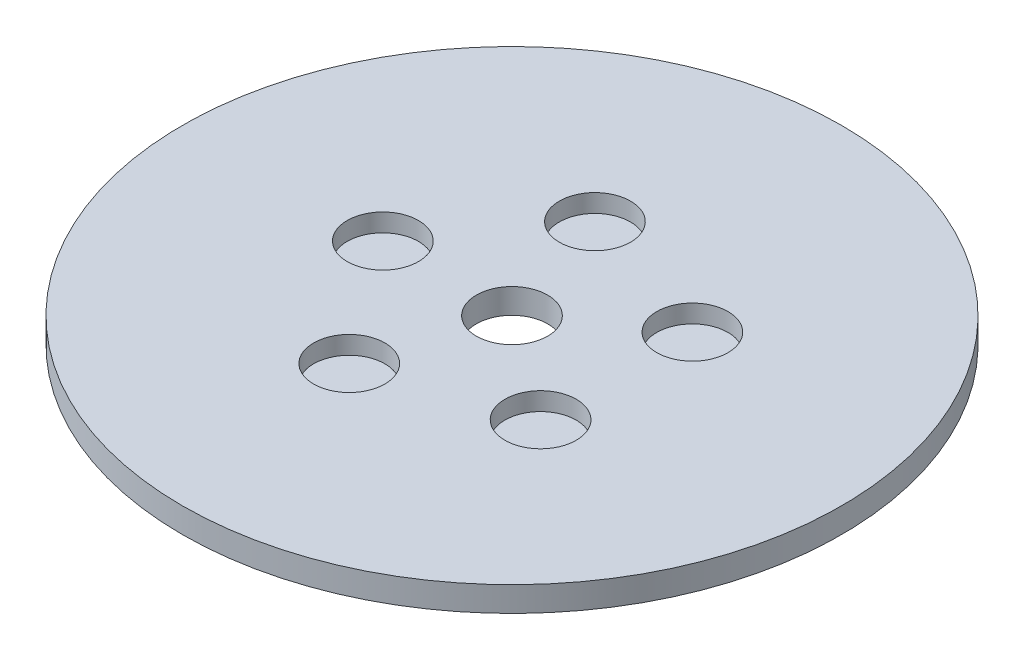
ISO-10303-21;
HEADER;
FILE_DESCRIPTION(('STEP AP214'),'2;1');
FILE_NAME('part.step','',(''),(''),'','','');
FILE_SCHEMA(('AUTOMOTIVE_DESIGN { 1 0 10303 214 1 1 1 1 }'));
ENDSEC;
DATA;
#1=APPLICATION_CONTEXT('core data for automotive mechanical design processes');
#2=APPLICATION_PROTOCOL_DEFINITION('international standard','automotive_design',2000,#1);
#3=PRODUCT_CONTEXT('',#1,'mechanical');
#4=PRODUCT('Part','Part','',(#3));
#5=PRODUCT_RELATED_PRODUCT_CATEGORY('part','',(#4));
#6=PRODUCT_DEFINITION_FORMATION('','',#4);
#7=PRODUCT_DEFINITION_CONTEXT('part definition',#1,'design');
#8=PRODUCT_DEFINITION('design','',#6,#7);
#9=PRODUCT_DEFINITION_SHAPE('','',#8);
#10=(LENGTH_UNIT() NAMED_UNIT(*) SI_UNIT(.MILLI.,.METRE.));
#11=(NAMED_UNIT(*) PLANE_ANGLE_UNIT() SI_UNIT($,.RADIAN.));
#12=(NAMED_UNIT(*) SI_UNIT($,.STERADIAN.) SOLID_ANGLE_UNIT());
#13=UNCERTAINTY_MEASURE_WITH_UNIT(LENGTH_MEASURE(1.E-05),#10,'distance_accuracy_value','');
#14=(GEOMETRIC_REPRESENTATION_CONTEXT(3) GLOBAL_UNCERTAINTY_ASSIGNED_CONTEXT((#13)) GLOBAL_UNIT_ASSIGNED_CONTEXT((#10,
#11,#12)) REPRESENTATION_CONTEXT('',''));
#15=CARTESIAN_POINT('',(0.,0.,0.));
#16=DIRECTION('',(0.,0.,1.));
#17=DIRECTION('',(1.,0.,0.));
#18=AXIS2_PLACEMENT_3D('',#15,#16,#17);
#19=CARTESIAN_POINT('',(0.,7.,0.));
#20=DIRECTION('',(0.,-1.,0.));
#21=DIRECTION('',(0.,0.,-1.));
#22=AXIS2_PLACEMENT_3D('',#19,#20,#21);
#23=CYLINDRICAL_SURFACE('',#22,92.5);
#24=CARTESIAN_POINT('',(0.,7.,0.));
#25=DIRECTION('',(0.,1.,0.));
#26=DIRECTION('',(0.,0.,1.));
#27=AXIS2_PLACEMENT_3D('',#24,#25,#26);
#28=CIRCLE('',#27,92.5);
#29=CARTESIAN_POINT('',(0.,7.,92.5));
#30=VERTEX_POINT('',#29);
#31=EDGE_CURVE('E10',#30,#30,#28,.T.);
#32=ORIENTED_EDGE('',*,*,#31,.F.);
#33=EDGE_LOOP('',(#32));
#34=FACE_BOUND('',#33,.T.);
#35=CARTESIAN_POINT('',(0.,0.,0.));
#36=DIRECTION('',(0.,1.,0.));
#37=DIRECTION('',(0.,0.,1.));
#38=AXIS2_PLACEMENT_3D('',#35,#36,#37);
#39=CIRCLE('',#38,92.5);
#40=CARTESIAN_POINT('',(0.,0.,92.5));
#41=VERTEX_POINT('',#40);
#42=EDGE_CURVE('E37',#41,#41,#39,.T.);
#43=ORIENTED_EDGE('',*,*,#42,.T.);
#44=EDGE_LOOP('',(#43));
#45=FACE_BOUND('',#44,.T.);
#46=ADVANCED_FACE('F40',(#34,#45),#23,.T.);
#47=CARTESIAN_POINT('',(0.,7.,0.));
#48=DIRECTION('',(0.,1.,0.));
#49=DIRECTION('',(0.,0.,1.));
#50=AXIS2_PLACEMENT_3D('',#47,#48,#49);
#51=PLANE('',#50);
#52=CARTESIAN_POINT('',(-11.2017564233093,7.,-34.4754613314648));
#53=DIRECTION('',(0.,1.,0.));
#54=DIRECTION('',(-0.95105651629515,0.,0.309016994374958));
#55=AXIS2_PLACEMENT_3D('',#52,#53,#54);
#56=CIRCLE('',#55,10.);
#57=CARTESIAN_POINT('',(-20.7123215862608,7.,-31.3852913877153));
#58=VERTEX_POINT('',#57);
#59=EDGE_CURVE('E70',#58,#58,#56,.T.);
#60=ORIENTED_EDGE('',*,*,#59,.F.);
#61=EDGE_LOOP('',(#60));
#62=FACE_BOUND('',#61,.T.);
#63=CARTESIAN_POINT('',(29.32657904992,7.,-21.3070068806783));
#64=DIRECTION('',(0.,1.,0.));
#65=DIRECTION('',(-0.58778525229248,0.,-0.809016994374942));
#66=AXIS2_PLACEMENT_3D('',#63,#64,#65);
#67=CIRCLE('',#66,10.);
#68=CARTESIAN_POINT('',(23.4487265269952,7.,-29.3971768244277));
#69=VERTEX_POINT('',#68);
#70=EDGE_CURVE('E71',#69,#69,#67,.T.);
#71=ORIENTED_EDGE('',*,*,#70,.F.);
#72=EDGE_LOOP('',(#71));
#73=FACE_BOUND('',#72,.T.);
#74=CARTESIAN_POINT('',(29.3265790499203,7.,21.3070068806779));
#75=DIRECTION('',(0.,1.,0.));
#76=DIRECTION('',(0.587785252292469,0.,-0.809016994374951));
#77=AXIS2_PLACEMENT_3D('',#74,#75,#76);
#78=CIRCLE('',#77,10.);
#79=CARTESIAN_POINT('',(35.204431572845,7.,13.2168369369284));
#80=VERTEX_POINT('',#79);
#81=EDGE_CURVE('E78',#80,#80,#78,.T.);
#82=ORIENTED_EDGE('',*,*,#81,.F.);
#83=EDGE_LOOP('',(#82));
#84=FACE_BOUND('',#83,.T.);
#85=CARTESIAN_POINT('',(-11.2017564233088,7.,34.475461331465));
#86=DIRECTION('',(0.,1.,0.));
#87=DIRECTION('',(0.951056516295155,0.,0.309016994374945));
#88=AXIS2_PLACEMENT_3D('',#85,#86,#87);
#89=CIRCLE('',#88,10.);
#90=CARTESIAN_POINT('',(-1.69119126035727,7.,37.5656312752145));
#91=VERTEX_POINT('',#90);
#92=EDGE_CURVE('E61',#91,#91,#89,.T.);
#93=ORIENTED_EDGE('',*,*,#92,.F.);
#94=EDGE_LOOP('',(#93));
#95=FACE_BOUND('',#94,.T.);
#96=CARTESIAN_POINT('',(-36.2496452532225,7.,0.));
#97=DIRECTION('',(0.,1.,0.));
#98=DIRECTION('',(0.,0.,1.));
#99=AXIS2_PLACEMENT_3D('',#96,#97,#98);
#100=CIRCLE('',#99,10.);
#101=CARTESIAN_POINT('',(-36.2496452532225,7.,10.));
#102=VERTEX_POINT('',#101);
#103=EDGE_CURVE('E54',#102,#102,#100,.T.);
#104=ORIENTED_EDGE('',*,*,#103,.F.);
#105=EDGE_LOOP('',(#104));
#106=FACE_BOUND('',#105,.T.);
#107=CARTESIAN_POINT('',(0.,7.,0.));
#108=DIRECTION('',(0.,1.,0.));
#109=DIRECTION('',(0.,0.,1.));
#110=AXIS2_PLACEMENT_3D('',#107,#108,#109);
#111=CIRCLE('',#110,10.);
#112=CARTESIAN_POINT('',(0.,7.,10.));
#113=VERTEX_POINT('',#112);
#114=EDGE_CURVE('E50',#113,#113,#111,.T.);
#115=ORIENTED_EDGE('',*,*,#114,.F.);
#116=EDGE_LOOP('',(#115));
#117=FACE_BOUND('',#116,.T.);
#118=ORIENTED_EDGE('',*,*,#31,.T.);
#119=EDGE_LOOP('',(#118));
#120=FACE_BOUND('',#119,.T.);
#121=ADVANCED_FACE('F94',(#62,#73,#84,#95,#106,#117,#120),#51,.T.);
#122=CARTESIAN_POINT('',(0.,0.,0.));
#123=DIRECTION('',(0.,1.,0.));
#124=DIRECTION('',(0.,0.,1.));
#125=AXIS2_PLACEMENT_3D('',#122,#123,#124);
#126=PLANE('',#125);
#127=CARTESIAN_POINT('',(0.,0.,0.));
#128=DIRECTION('',(0.,1.,0.));
#129=DIRECTION('',(0.,0.,1.));
#130=AXIS2_PLACEMENT_3D('',#127,#128,#129);
#131=CIRCLE('',#130,10.);
#132=CARTESIAN_POINT('',(0.,0.,10.));
#133=VERTEX_POINT('',#132);
#134=EDGE_CURVE('E47',#133,#133,#131,.T.);
#135=ORIENTED_EDGE('',*,*,#134,.T.);
#136=EDGE_LOOP('',(#135));
#137=FACE_BOUND('',#136,.T.);
#138=ORIENTED_EDGE('',*,*,#42,.F.);
#139=EDGE_LOOP('',(#138));
#140=FACE_BOUND('',#139,.T.);
#141=ADVANCED_FACE('F100',(#137,#140),#126,.F.);
#142=CARTESIAN_POINT('',(0.,7.,0.));
#143=DIRECTION('',(0.,-1.,0.));
#144=DIRECTION('',(0.,0.,-1.));
#145=AXIS2_PLACEMENT_3D('',#142,#143,#144);
#146=CYLINDRICAL_SURFACE('',#145,10.);
#147=ORIENTED_EDGE('',*,*,#114,.T.);
#148=EDGE_LOOP('',(#147));
#149=FACE_BOUND('',#148,.T.);
#150=ORIENTED_EDGE('',*,*,#134,.F.);
#151=EDGE_LOOP('',(#150));
#152=FACE_BOUND('',#151,.T.);
#153=ADVANCED_FACE('F106',(#149,#152),#146,.F.);
#154=CARTESIAN_POINT('',(-36.2496452532225,1.92063490597726,0.));
#155=DIRECTION('',(0.,1.,0.));
#156=DIRECTION('',(0.,0.,1.));
#157=AXIS2_PLACEMENT_3D('',#154,#155,#156);
#158=CYLINDRICAL_SURFACE('',#157,10.);
#159=CARTESIAN_POINT('',(-36.2496452532225,1.92063490597726,0.));
#160=DIRECTION('',(0.,1.,0.));
#161=DIRECTION('',(0.,0.,1.));
#162=AXIS2_PLACEMENT_3D('',#159,#160,#161);
#163=CIRCLE('',#162,10.);
#164=CARTESIAN_POINT('',(-36.2496452532225,1.92063490597726,10.));
#165=VERTEX_POINT('',#164);
#166=EDGE_CURVE('E55',#165,#165,#163,.T.);
#167=ORIENTED_EDGE('',*,*,#166,.F.);
#168=EDGE_LOOP('',(#167));
#169=FACE_BOUND('',#168,.T.);
#170=ORIENTED_EDGE('',*,*,#103,.T.);
#171=EDGE_LOOP('',(#170));
#172=FACE_BOUND('',#171,.T.);
#173=ADVANCED_FACE('F108',(#169,#172),#158,.F.);
#174=CARTESIAN_POINT('',(-36.2496452532225,1.92063490597726,0.));
#175=DIRECTION('',(0.,1.,0.));
#176=DIRECTION('',(0.,0.,1.));
#177=AXIS2_PLACEMENT_3D('',#174,#175,#176);
#178=PLANE('',#177);
#179=ORIENTED_EDGE('',*,*,#166,.T.);
#180=EDGE_LOOP('',(#179));
#181=FACE_BOUND('',#180,.T.);
#182=ADVANCED_FACE('F138',(#181),#178,.T.);
#183=CARTESIAN_POINT('',(-11.2017564233088,1.92063490597726,34.475461331465));
#184=DIRECTION('',(0.,1.,0.));
#185=DIRECTION('',(0.,0.,1.));
#186=AXIS2_PLACEMENT_3D('',#183,#184,#185);
#187=CYLINDRICAL_SURFACE('',#186,10.);
#188=CARTESIAN_POINT('',(-11.2017564233088,1.92063490597726,34.475461331465));
#189=DIRECTION('',(0.,1.,0.));
#190=DIRECTION('',(0.951056516295155,0.,0.309016994374945));
#191=AXIS2_PLACEMENT_3D('',#188,#189,#190);
#192=CIRCLE('',#191,10.);
#193=CARTESIAN_POINT('',(-1.69119126035727,1.92063490597726,37.5656312752145));
#194=VERTEX_POINT('',#193);
#195=EDGE_CURVE('E59',#194,#194,#192,.T.);
#196=ORIENTED_EDGE('',*,*,#195,.F.);
#197=EDGE_LOOP('',(#196));
#198=FACE_BOUND('',#197,.T.);
#199=ORIENTED_EDGE('',*,*,#92,.T.);
#200=EDGE_LOOP('',(#199));
#201=FACE_BOUND('',#200,.T.);
#202=ADVANCED_FACE('F150',(#198,#201),#187,.F.);
#203=CARTESIAN_POINT('',(-11.2017564233088,1.92063490597726,34.475461331465));
#204=DIRECTION('',(0.,1.,0.));
#205=DIRECTION('',(0.951056516295155,0.,0.309016994374945));
#206=AXIS2_PLACEMENT_3D('',#203,#204,#205);
#207=PLANE('',#206);
#208=ORIENTED_EDGE('',*,*,#195,.T.);
#209=EDGE_LOOP('',(#208));
#210=FACE_BOUND('',#209,.T.);
#211=ADVANCED_FACE('F89',(#210),#207,.T.);
#212=CARTESIAN_POINT('',(29.3265790499203,1.92063490597726,21.3070068806779));
#213=DIRECTION('',(0.,1.,0.));
#214=DIRECTION('',(0.,0.,1.));
#215=AXIS2_PLACEMENT_3D('',#212,#213,#214);
#216=CYLINDRICAL_SURFACE('',#215,10.);
#217=CARTESIAN_POINT('',(29.3265790499203,1.92063490597726,21.3070068806779));
#218=DIRECTION('',(0.,1.,0.));
#219=DIRECTION('',(0.587785252292469,0.,-0.809016994374951));
#220=AXIS2_PLACEMENT_3D('',#217,#218,#219);
#221=CIRCLE('',#220,10.);
#222=CARTESIAN_POINT('',(35.204431572845,1.92063490597726,13.2168369369284));
#223=VERTEX_POINT('',#222);
#224=EDGE_CURVE('E63',#223,#223,#221,.T.);
#225=ORIENTED_EDGE('',*,*,#224,.F.);
#226=EDGE_LOOP('',(#225));
#227=FACE_BOUND('',#226,.T.);
#228=ORIENTED_EDGE('',*,*,#81,.T.);
#229=EDGE_LOOP('',(#228));
#230=FACE_BOUND('',#229,.T.);
#231=ADVANCED_FACE('F87',(#227,#230),#216,.F.);
#232=CARTESIAN_POINT('',(29.3265790499203,1.92063490597726,21.3070068806779));
#233=DIRECTION('',(0.,1.,0.));
#234=DIRECTION('',(0.587785252292469,0.,-0.809016994374951));
#235=AXIS2_PLACEMENT_3D('',#232,#233,#234);
#236=PLANE('',#235);
#237=ORIENTED_EDGE('',*,*,#224,.T.);
#238=EDGE_LOOP('',(#237));
#239=FACE_BOUND('',#238,.T.);
#240=ADVANCED_FACE('F84',(#239),#236,.T.);
#241=CARTESIAN_POINT('',(29.32657904992,1.92063490597726,-21.3070068806783));
#242=DIRECTION('',(0.,1.,0.));
#243=DIRECTION('',(0.,0.,1.));
#244=AXIS2_PLACEMENT_3D('',#241,#242,#243);
#245=CYLINDRICAL_SURFACE('',#244,10.);
#246=CARTESIAN_POINT('',(29.32657904992,1.92063490597726,-21.3070068806783));
#247=DIRECTION('',(0.,1.,0.));
#248=DIRECTION('',(-0.58778525229248,0.,-0.809016994374942));
#249=AXIS2_PLACEMENT_3D('',#246,#247,#248);
#250=CIRCLE('',#249,10.);
#251=CARTESIAN_POINT('',(23.4487265269952,1.92063490597726,-29.3971768244277));
#252=VERTEX_POINT('',#251);
#253=EDGE_CURVE('E76',#252,#252,#250,.T.);
#254=ORIENTED_EDGE('',*,*,#253,.F.);
#255=EDGE_LOOP('',(#254));
#256=FACE_BOUND('',#255,.T.);
#257=ORIENTED_EDGE('',*,*,#70,.T.);
#258=EDGE_LOOP('',(#257));
#259=FACE_BOUND('',#258,.T.);
#260=ADVANCED_FACE('F185',(#256,#259),#245,.F.);
#261=CARTESIAN_POINT('',(29.32657904992,1.92063490597726,-21.3070068806783));
#262=DIRECTION('',(0.,1.,0.));
#263=DIRECTION('',(-0.58778525229248,0.,-0.809016994374942));
#264=AXIS2_PLACEMENT_3D('',#261,#262,#263);
#265=PLANE('',#264);
#266=ORIENTED_EDGE('',*,*,#253,.T.);
#267=EDGE_LOOP('',(#266));
#268=FACE_BOUND('',#267,.T.);
#269=ADVANCED_FACE('F189',(#268),#265,.T.);
#270=CARTESIAN_POINT('',(-11.2017564233093,1.92063490597726,-34.4754613314648));
#271=DIRECTION('',(0.,1.,0.));
#272=DIRECTION('',(0.,0.,1.));
#273=AXIS2_PLACEMENT_3D('',#270,#271,#272);
#274=CYLINDRICAL_SURFACE('',#273,10.);
#275=CARTESIAN_POINT('',(-11.2017564233093,1.92063490597726,-34.4754613314648));
#276=DIRECTION('',(0.,1.,0.));
#277=DIRECTION('',(-0.95105651629515,0.,0.309016994374958));
#278=AXIS2_PLACEMENT_3D('',#275,#276,#277);
#279=CIRCLE('',#278,10.);
#280=CARTESIAN_POINT('',(-20.7123215862608,1.92063490597726,-31.3852913877153));
#281=VERTEX_POINT('',#280);
#282=EDGE_CURVE('E69',#281,#281,#279,.T.);
#283=ORIENTED_EDGE('',*,*,#282,.F.);
#284=EDGE_LOOP('',(#283));
#285=FACE_BOUND('',#284,.T.);
#286=ORIENTED_EDGE('',*,*,#59,.T.);
#287=EDGE_LOOP('',(#286));
#288=FACE_BOUND('',#287,.T.);
#289=ADVANCED_FACE('F200',(#285,#288),#274,.F.);
#290=CARTESIAN_POINT('',(-11.2017564233093,1.92063490597726,-34.4754613314648));
#291=DIRECTION('',(0.,1.,0.));
#292=DIRECTION('',(-0.95105651629515,0.,0.309016994374958));
#293=AXIS2_PLACEMENT_3D('',#290,#291,#292);
#294=PLANE('',#293);
#295=ORIENTED_EDGE('',*,*,#282,.T.);
#296=EDGE_LOOP('',(#295));
#297=FACE_BOUND('',#296,.T.);
#298=ADVANCED_FACE('F208',(#297),#294,.T.);
#299=CLOSED_SHELL('',(#46,#121,#141,#153,#173,#182,#202,#211,#231,#240,#260,#269,#289,#298));
#300=MANIFOLD_SOLID_BREP('B2',#299);
#301=ADVANCED_BREP_SHAPE_REPRESENTATION('',(#18,#300),#14);
#302=SHAPE_DEFINITION_REPRESENTATION(#9,#301);
ENDSEC;
END-ISO-10303-21;
